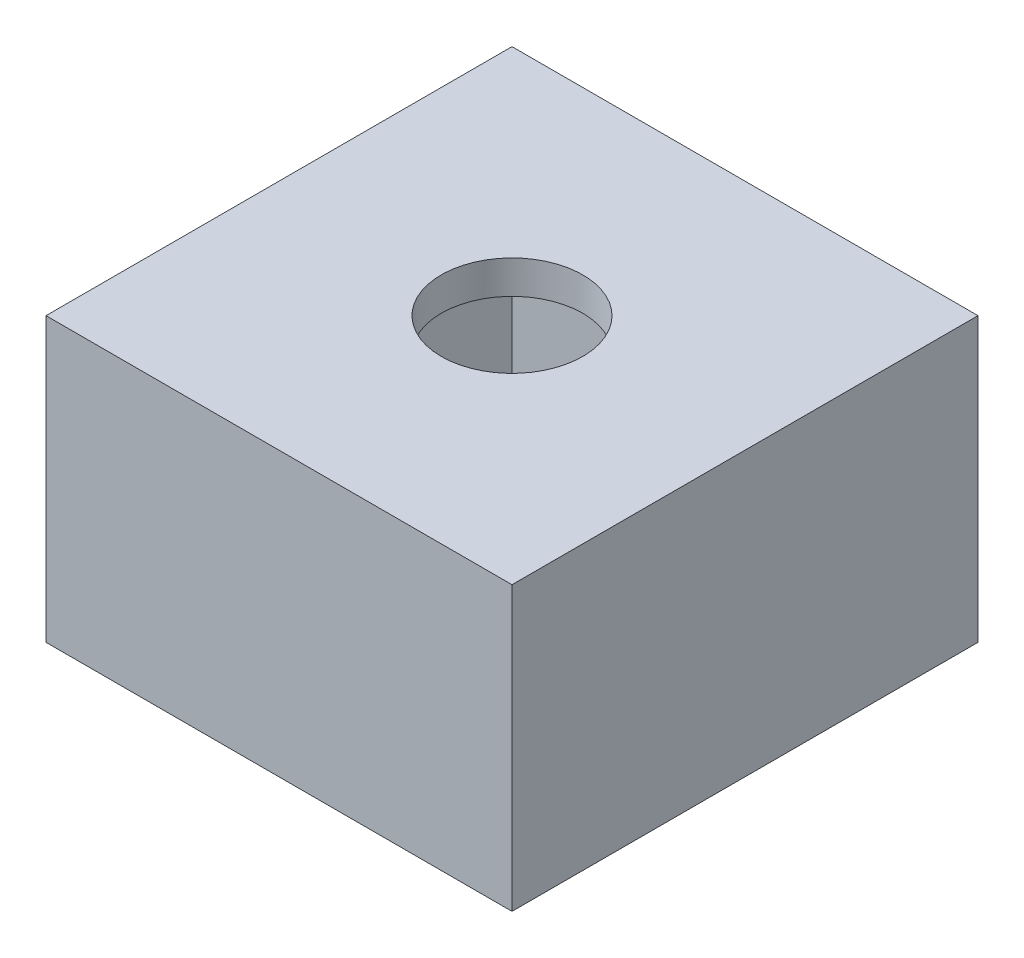
ISO-10303-21;
HEADER;
FILE_DESCRIPTION(('STEP AP214'),'2;1');
FILE_NAME('part.step','',(''),(''),'','','');
FILE_SCHEMA(('AUTOMOTIVE_DESIGN { 1 0 10303 214 1 1 1 1 }'));
ENDSEC;
DATA;
#1=APPLICATION_CONTEXT('core data for automotive mechanical design processes');
#2=APPLICATION_PROTOCOL_DEFINITION('international standard','automotive_design',2000,#1);
#3=PRODUCT_CONTEXT('',#1,'mechanical');
#4=PRODUCT('Part','Part','',(#3));
#5=PRODUCT_RELATED_PRODUCT_CATEGORY('part','',(#4));
#6=PRODUCT_DEFINITION_FORMATION('','',#4);
#7=PRODUCT_DEFINITION_CONTEXT('part definition',#1,'design');
#8=PRODUCT_DEFINITION('design','',#6,#7);
#9=PRODUCT_DEFINITION_SHAPE('','',#8);
#10=(LENGTH_UNIT() NAMED_UNIT(*) SI_UNIT(.MILLI.,.METRE.));
#11=(NAMED_UNIT(*) PLANE_ANGLE_UNIT() SI_UNIT($,.RADIAN.));
#12=(NAMED_UNIT(*) SI_UNIT($,.STERADIAN.) SOLID_ANGLE_UNIT());
#13=UNCERTAINTY_MEASURE_WITH_UNIT(LENGTH_MEASURE(1.E-05),#10,'distance_accuracy_value','');
#14=(GEOMETRIC_REPRESENTATION_CONTEXT(3) GLOBAL_UNCERTAINTY_ASSIGNED_CONTEXT((#13)) GLOBAL_UNIT_ASSIGNED_CONTEXT((#10,
#11,#12)) REPRESENTATION_CONTEXT('',''));
#15=CARTESIAN_POINT('',(0.,0.,0.));
#16=DIRECTION('',(0.,0.,1.));
#17=DIRECTION('',(1.,0.,0.));
#18=AXIS2_PLACEMENT_3D('',#15,#16,#17);
#19=CARTESIAN_POINT('',(0.,0.,0.));
#20=DIRECTION('',(0.,1.,0.));
#21=DIRECTION('',(0.,0.,1.));
#22=AXIS2_PLACEMENT_3D('',#19,#20,#21);
#23=PLANE('',#22);
#24=DIRECTION('',(0.,0.,-1.));
#25=VECTOR('',#24,1.);
#26=CARTESIAN_POINT('',(14.,0.,14.));
#27=LINE('',#26,#25);
#28=CARTESIAN_POINT('',(14.,0.,14.));
#29=VERTEX_POINT('',#28);
#30=CARTESIAN_POINT('',(14.,0.,-14.));
#31=VERTEX_POINT('',#30);
#32=EDGE_CURVE('E107',#29,#31,#27,.T.);
#33=ORIENTED_EDGE('',*,*,#32,.F.);
#34=DIRECTION('',(1.,0.,0.));
#35=VECTOR('',#34,1.);
#36=CARTESIAN_POINT('',(14.,0.,14.));
#37=LINE('',#36,#35);
#38=CARTESIAN_POINT('',(-14.,0.,14.));
#39=VERTEX_POINT('',#38);
#40=EDGE_CURVE('E58',#39,#29,#37,.T.);
#41=ORIENTED_EDGE('',*,*,#40,.F.);
#42=DIRECTION('',(0.,0.,1.));
#43=VECTOR('',#42,1.);
#44=CARTESIAN_POINT('',(-14.,0.,14.));
#45=LINE('',#44,#43);
#46=CARTESIAN_POINT('',(-14.,0.,-14.));
#47=VERTEX_POINT('',#46);
#48=EDGE_CURVE('E164',#47,#39,#45,.T.);
#49=ORIENTED_EDGE('',*,*,#48,.F.);
#50=DIRECTION('',(-1.,0.,0.));
#51=VECTOR('',#50,1.);
#52=CARTESIAN_POINT('',(14.,0.,-14.));
#53=LINE('',#52,#51);
#54=EDGE_CURVE('E162',#31,#47,#53,.T.);
#55=ORIENTED_EDGE('',*,*,#54,.F.);
#56=EDGE_LOOP('',(#33,#41,#49,#55));
#57=FACE_BOUND('',#56,.T.);
#58=DIRECTION('',(0.,0.,1.));
#59=VECTOR('',#58,1.);
#60=CARTESIAN_POINT('',(-12.,0.,12.));
#61=LINE('',#60,#59);
#62=CARTESIAN_POINT('',(-12.,0.,-12.));
#63=VERTEX_POINT('',#62);
#64=CARTESIAN_POINT('',(-12.,0.,12.));
#65=VERTEX_POINT('',#64);
#66=EDGE_CURVE('E50',#63,#65,#61,.T.);
#67=ORIENTED_EDGE('',*,*,#66,.T.);
#68=DIRECTION('',(1.,0.,0.));
#69=VECTOR('',#68,1.);
#70=CARTESIAN_POINT('',(12.,0.,12.));
#71=LINE('',#70,#69);
#72=CARTESIAN_POINT('',(12.,0.,12.));
#73=VERTEX_POINT('',#72);
#74=EDGE_CURVE('E146',#65,#73,#71,.T.);
#75=ORIENTED_EDGE('',*,*,#74,.T.);
#76=DIRECTION('',(0.,0.,-1.));
#77=VECTOR('',#76,1.);
#78=CARTESIAN_POINT('',(12.,0.,12.));
#79=LINE('',#78,#77);
#80=CARTESIAN_POINT('',(12.,0.,-12.));
#81=VERTEX_POINT('',#80);
#82=EDGE_CURVE('E149',#73,#81,#79,.T.);
#83=ORIENTED_EDGE('',*,*,#82,.T.);
#84=DIRECTION('',(-1.,0.,0.));
#85=VECTOR('',#84,1.);
#86=CARTESIAN_POINT('',(12.,0.,-12.));
#87=LINE('',#86,#85);
#88=EDGE_CURVE('E135',#81,#63,#87,.T.);
#89=ORIENTED_EDGE('',*,*,#88,.T.);
#90=EDGE_LOOP('',(#67,#75,#83,#89));
#91=FACE_BOUND('',#90,.T.);
#92=ADVANCED_FACE('F35',(#57,#91),#23,.F.);
#93=CARTESIAN_POINT('',(14.,15.,14.));
#94=DIRECTION('',(-1.,0.,0.));
#95=DIRECTION('',(0.,0.,1.));
#96=AXIS2_PLACEMENT_3D('',#93,#94,#95);
#97=PLANE('',#96);
#98=ORIENTED_EDGE('',*,*,#32,.T.);
#99=DIRECTION('',(0.,-1.,0.));
#100=VECTOR('',#99,1.);
#101=CARTESIAN_POINT('',(14.,15.,-14.));
#102=LINE('',#101,#100);
#103=CARTESIAN_POINT('',(14.,17.,-14.));
#104=VERTEX_POINT('',#103);
#105=EDGE_CURVE('E11',#104,#31,#102,.T.);
#106=ORIENTED_EDGE('',*,*,#105,.F.);
#107=DIRECTION('',(0.,0.,-1.));
#108=VECTOR('',#107,1.);
#109=CARTESIAN_POINT('',(14.,17.,14.));
#110=LINE('',#109,#108);
#111=CARTESIAN_POINT('',(14.,17.,14.));
#112=VERTEX_POINT('',#111);
#113=EDGE_CURVE('E105',#112,#104,#110,.T.);
#114=ORIENTED_EDGE('',*,*,#113,.F.);
#115=DIRECTION('',(0.,-1.,0.));
#116=VECTOR('',#115,1.);
#117=CARTESIAN_POINT('',(14.,15.,14.));
#118=LINE('',#117,#116);
#119=EDGE_CURVE('E167',#112,#29,#118,.T.);
#120=ORIENTED_EDGE('',*,*,#119,.T.);
#121=EDGE_LOOP('',(#98,#106,#114,#120));
#122=FACE_BOUND('',#121,.T.);
#123=ADVANCED_FACE('F37',(#122),#97,.F.);
#124=CARTESIAN_POINT('',(14.,15.,-14.));
#125=DIRECTION('',(0.,0.,1.));
#126=DIRECTION('',(1.,0.,0.));
#127=AXIS2_PLACEMENT_3D('',#124,#125,#126);
#128=PLANE('',#127);
#129=ORIENTED_EDGE('',*,*,#54,.T.);
#130=DIRECTION('',(0.,-1.,0.));
#131=VECTOR('',#130,1.);
#132=CARTESIAN_POINT('',(-14.,15.,-14.));
#133=LINE('',#132,#131);
#134=CARTESIAN_POINT('',(-14.,17.,-14.));
#135=VERTEX_POINT('',#134);
#136=EDGE_CURVE('E43',#135,#47,#133,.T.);
#137=ORIENTED_EDGE('',*,*,#136,.F.);
#138=DIRECTION('',(-1.,0.,0.));
#139=VECTOR('',#138,1.);
#140=CARTESIAN_POINT('',(-14.,17.,-14.));
#141=LINE('',#140,#139);
#142=EDGE_CURVE('E110',#104,#135,#141,.T.);
#143=ORIENTED_EDGE('',*,*,#142,.F.);
#144=ORIENTED_EDGE('',*,*,#105,.T.);
#145=EDGE_LOOP('',(#129,#137,#143,#144));
#146=FACE_BOUND('',#145,.T.);
#147=ADVANCED_FACE('F111',(#146),#128,.F.);
#148=CARTESIAN_POINT('',(-14.,15.,14.));
#149=DIRECTION('',(1.,0.,0.));
#150=DIRECTION('',(0.,0.,-1.));
#151=AXIS2_PLACEMENT_3D('',#148,#149,#150);
#152=PLANE('',#151);
#153=ORIENTED_EDGE('',*,*,#48,.T.);
#154=DIRECTION('',(0.,-1.,0.));
#155=VECTOR('',#154,1.);
#156=CARTESIAN_POINT('',(-14.,15.,14.));
#157=LINE('',#156,#155);
#158=CARTESIAN_POINT('',(-14.,17.,14.));
#159=VERTEX_POINT('',#158);
#160=EDGE_CURVE('E169',#159,#39,#157,.T.);
#161=ORIENTED_EDGE('',*,*,#160,.F.);
#162=DIRECTION('',(0.,0.,1.));
#163=VECTOR('',#162,1.);
#164=CARTESIAN_POINT('',(-14.,17.,14.));
#165=LINE('',#164,#163);
#166=EDGE_CURVE('E116',#135,#159,#165,.T.);
#167=ORIENTED_EDGE('',*,*,#166,.F.);
#168=ORIENTED_EDGE('',*,*,#136,.T.);
#169=EDGE_LOOP('',(#153,#161,#167,#168));
#170=FACE_BOUND('',#169,.T.);
#171=ADVANCED_FACE('F172',(#170),#152,.F.);
#172=CARTESIAN_POINT('',(14.,15.,14.));
#173=DIRECTION('',(0.,0.,-1.));
#174=DIRECTION('',(-1.,0.,0.));
#175=AXIS2_PLACEMENT_3D('',#172,#173,#174);
#176=PLANE('',#175);
#177=ORIENTED_EDGE('',*,*,#40,.T.);
#178=ORIENTED_EDGE('',*,*,#119,.F.);
#179=DIRECTION('',(1.,0.,0.));
#180=VECTOR('',#179,1.);
#181=CARTESIAN_POINT('',(-14.,17.,14.));
#182=LINE('',#181,#180);
#183=EDGE_CURVE('E121',#159,#112,#182,.T.);
#184=ORIENTED_EDGE('',*,*,#183,.F.);
#185=ORIENTED_EDGE('',*,*,#160,.T.);
#186=EDGE_LOOP('',(#177,#178,#184,#185));
#187=FACE_BOUND('',#186,.T.);
#188=ADVANCED_FACE('F210',(#187),#176,.F.);
#189=CARTESIAN_POINT('',(-12.,15.,12.));
#190=DIRECTION('',(1.,0.,0.));
#191=DIRECTION('',(0.,0.,-1.));
#192=AXIS2_PLACEMENT_3D('',#189,#190,#191);
#193=PLANE('',#192);
#194=ORIENTED_EDGE('',*,*,#66,.F.);
#195=DIRECTION('',(0.,-1.,0.));
#196=VECTOR('',#195,1.);
#197=CARTESIAN_POINT('',(-12.,15.,-12.));
#198=LINE('',#197,#196);
#199=CARTESIAN_POINT('',(-12.,15.,-12.));
#200=VERTEX_POINT('',#199);
#201=EDGE_CURVE('E144',#200,#63,#198,.T.);
#202=ORIENTED_EDGE('',*,*,#201,.F.);
#203=DIRECTION('',(0.,0.,1.));
#204=VECTOR('',#203,1.);
#205=CARTESIAN_POINT('',(-12.,15.,12.));
#206=LINE('',#205,#204);
#207=CARTESIAN_POINT('',(-12.,15.,12.));
#208=VERTEX_POINT('',#207);
#209=EDGE_CURVE('E131',#200,#208,#206,.T.);
#210=ORIENTED_EDGE('',*,*,#209,.T.);
#211=DIRECTION('',(0.,-1.,0.));
#212=VECTOR('',#211,1.);
#213=CARTESIAN_POINT('',(-12.,15.,12.));
#214=LINE('',#213,#212);
#215=EDGE_CURVE('E159',#208,#65,#214,.T.);
#216=ORIENTED_EDGE('',*,*,#215,.T.);
#217=EDGE_LOOP('',(#194,#202,#210,#216));
#218=FACE_BOUND('',#217,.T.);
#219=ADVANCED_FACE('F182',(#218),#193,.T.);
#220=CARTESIAN_POINT('',(12.,15.,12.));
#221=DIRECTION('',(0.,0.,-1.));
#222=DIRECTION('',(-1.,0.,0.));
#223=AXIS2_PLACEMENT_3D('',#220,#221,#222);
#224=PLANE('',#223);
#225=ORIENTED_EDGE('',*,*,#74,.F.);
#226=ORIENTED_EDGE('',*,*,#215,.F.);
#227=DIRECTION('',(1.,0.,0.));
#228=VECTOR('',#227,1.);
#229=CARTESIAN_POINT('',(12.,15.,12.));
#230=LINE('',#229,#228);
#231=CARTESIAN_POINT('',(12.,15.,12.));
#232=VERTEX_POINT('',#231);
#233=EDGE_CURVE('E134',#208,#232,#230,.T.);
#234=ORIENTED_EDGE('',*,*,#233,.T.);
#235=DIRECTION('',(0.,-1.,0.));
#236=VECTOR('',#235,1.);
#237=CARTESIAN_POINT('',(12.,15.,12.));
#238=LINE('',#237,#236);
#239=EDGE_CURVE('E157',#232,#73,#238,.T.);
#240=ORIENTED_EDGE('',*,*,#239,.T.);
#241=EDGE_LOOP('',(#225,#226,#234,#240));
#242=FACE_BOUND('',#241,.T.);
#243=ADVANCED_FACE('F186',(#242),#224,.T.);
#244=CARTESIAN_POINT('',(12.,15.,12.));
#245=DIRECTION('',(-1.,0.,0.));
#246=DIRECTION('',(0.,0.,1.));
#247=AXIS2_PLACEMENT_3D('',#244,#245,#246);
#248=PLANE('',#247);
#249=ORIENTED_EDGE('',*,*,#82,.F.);
#250=ORIENTED_EDGE('',*,*,#239,.F.);
#251=DIRECTION('',(0.,0.,-1.));
#252=VECTOR('',#251,1.);
#253=CARTESIAN_POINT('',(12.,15.,12.));
#254=LINE('',#253,#252);
#255=CARTESIAN_POINT('',(12.,15.,-12.));
#256=VERTEX_POINT('',#255);
#257=EDGE_CURVE('E138',#232,#256,#254,.T.);
#258=ORIENTED_EDGE('',*,*,#257,.T.);
#259=DIRECTION('',(0.,-1.,0.));
#260=VECTOR('',#259,1.);
#261=CARTESIAN_POINT('',(12.,15.,-12.));
#262=LINE('',#261,#260);
#263=EDGE_CURVE('E155',#256,#81,#262,.T.);
#264=ORIENTED_EDGE('',*,*,#263,.T.);
#265=EDGE_LOOP('',(#249,#250,#258,#264));
#266=FACE_BOUND('',#265,.T.);
#267=ADVANCED_FACE('F189',(#266),#248,.T.);
#268=CARTESIAN_POINT('',(12.,15.,-12.));
#269=DIRECTION('',(0.,0.,1.));
#270=DIRECTION('',(1.,0.,0.));
#271=AXIS2_PLACEMENT_3D('',#268,#269,#270);
#272=PLANE('',#271);
#273=ORIENTED_EDGE('',*,*,#88,.F.);
#274=ORIENTED_EDGE('',*,*,#263,.F.);
#275=DIRECTION('',(-1.,0.,0.));
#276=VECTOR('',#275,1.);
#277=CARTESIAN_POINT('',(12.,15.,-12.));
#278=LINE('',#277,#276);
#279=EDGE_CURVE('E141',#256,#200,#278,.T.);
#280=ORIENTED_EDGE('',*,*,#279,.T.);
#281=ORIENTED_EDGE('',*,*,#201,.T.);
#282=EDGE_LOOP('',(#273,#274,#280,#281));
#283=FACE_BOUND('',#282,.T.);
#284=ADVANCED_FACE('F181',(#283),#272,.T.);
#285=CARTESIAN_POINT('',(0.,15.,0.));
#286=DIRECTION('',(0.,-1.,0.));
#287=DIRECTION('',(0.,0.,-1.));
#288=AXIS2_PLACEMENT_3D('',#285,#286,#287);
#289=PLANE('',#288);
#290=CARTESIAN_POINT('',(0.,15.,0.));
#291=DIRECTION('',(0.,-1.,0.));
#292=DIRECTION('',(0.,0.,-1.));
#293=AXIS2_PLACEMENT_3D('',#290,#291,#292);
#294=CIRCLE('',#293,4.25);
#295=CARTESIAN_POINT('',(0.,15.,-4.25));
#296=VERTEX_POINT('',#295);
#297=EDGE_CURVE('E125',#296,#296,#294,.F.);
#298=ORIENTED_EDGE('',*,*,#297,.T.);
#299=EDGE_LOOP('',(#298));
#300=FACE_BOUND('',#299,.T.);
#301=ORIENTED_EDGE('',*,*,#233,.F.);
#302=ORIENTED_EDGE('',*,*,#209,.F.);
#303=ORIENTED_EDGE('',*,*,#279,.F.);
#304=ORIENTED_EDGE('',*,*,#257,.F.);
#305=EDGE_LOOP('',(#301,#302,#303,#304));
#306=FACE_BOUND('',#305,.T.);
#307=ADVANCED_FACE('F190',(#300,#306),#289,.T.);
#308=CARTESIAN_POINT('',(0.,17.,0.));
#309=DIRECTION('',(0.,-1.,0.));
#310=DIRECTION('',(0.,0.,-1.));
#311=AXIS2_PLACEMENT_3D('',#308,#309,#310);
#312=PLANE('',#311);
#313=CARTESIAN_POINT('',(0.,17.,0.));
#314=DIRECTION('',(0.,1.,0.));
#315=DIRECTION('',(0.,0.,1.));
#316=AXIS2_PLACEMENT_3D('',#313,#314,#315);
#317=CIRCLE('',#316,4.25);
#318=CARTESIAN_POINT('',(0.,17.,4.25));
#319=VERTEX_POINT('',#318);
#320=EDGE_CURVE('E122',#319,#319,#317,.T.);
#321=ORIENTED_EDGE('',*,*,#320,.F.);
#322=EDGE_LOOP('',(#321));
#323=FACE_BOUND('',#322,.T.);
#324=ORIENTED_EDGE('',*,*,#113,.T.);
#325=ORIENTED_EDGE('',*,*,#142,.T.);
#326=ORIENTED_EDGE('',*,*,#166,.T.);
#327=ORIENTED_EDGE('',*,*,#183,.T.);
#328=EDGE_LOOP('',(#324,#325,#326,#327));
#329=FACE_BOUND('',#328,.T.);
#330=ADVANCED_FACE('F119',(#323,#329),#312,.F.);
#331=CARTESIAN_POINT('',(0.,-0.001000000000001,0.));
#332=DIRECTION('',(0.,1.,0.));
#333=DIRECTION('',(0.,0.,1.));
#334=AXIS2_PLACEMENT_3D('',#331,#332,#333);
#335=CYLINDRICAL_SURFACE('',#334,4.25);
#336=ORIENTED_EDGE('',*,*,#297,.F.);
#337=EDGE_LOOP('',(#336));
#338=FACE_BOUND('',#337,.T.);
#339=ORIENTED_EDGE('',*,*,#320,.T.);
#340=EDGE_LOOP('',(#339));
#341=FACE_BOUND('',#340,.T.);
#342=ADVANCED_FACE('F198',(#338,#341),#335,.F.);
#343=CLOSED_SHELL('',(#92,#123,#147,#171,#188,#219,#243,#267,#284,#307,#330,#342));
#344=MANIFOLD_SOLID_BREP('B2',#343);
#345=ADVANCED_BREP_SHAPE_REPRESENTATION('',(#18,#344),#14);
#346=SHAPE_DEFINITION_REPRESENTATION(#9,#345);
ENDSEC;
END-ISO-10303-21;
